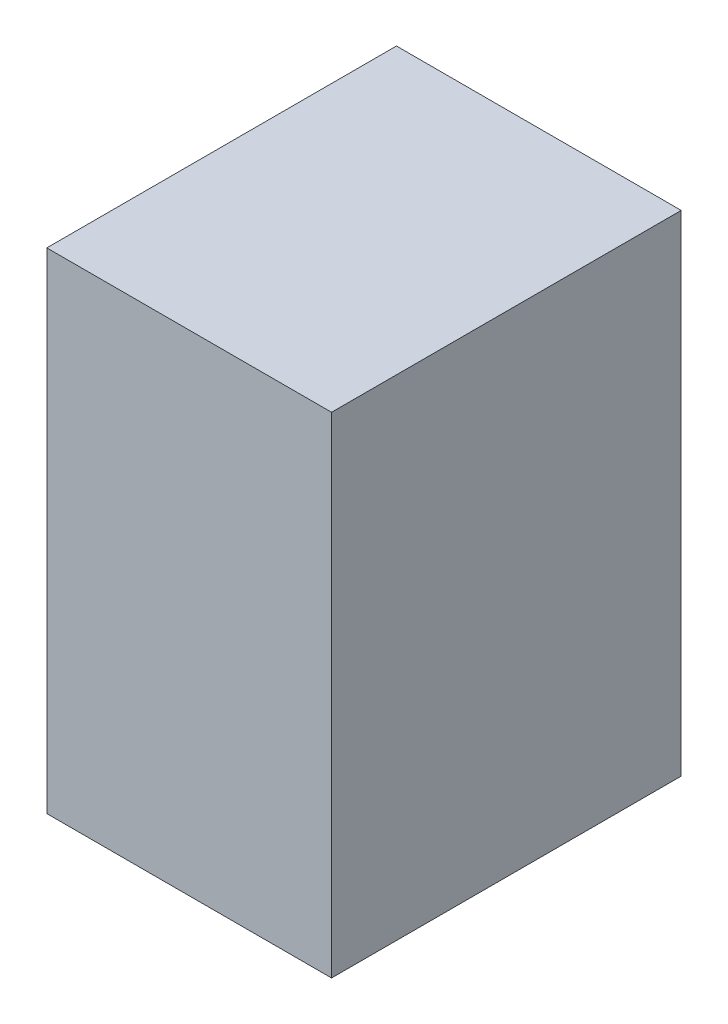
ISO-10303-21;
HEADER;
FILE_DESCRIPTION(('STEP AP214'),'2;1');
FILE_NAME('part.step','',(''),(''),'','','');
FILE_SCHEMA(('AUTOMOTIVE_DESIGN { 1 0 10303 214 1 1 1 1 }'));
ENDSEC;
DATA;
#1=APPLICATION_CONTEXT('core data for automotive mechanical design processes');
#2=APPLICATION_PROTOCOL_DEFINITION('international standard','automotive_design',2000,#1);
#3=PRODUCT_CONTEXT('',#1,'mechanical');
#4=PRODUCT('Part','Part','',(#3));
#5=PRODUCT_RELATED_PRODUCT_CATEGORY('part','',(#4));
#6=PRODUCT_DEFINITION_FORMATION('','',#4);
#7=PRODUCT_DEFINITION_CONTEXT('part definition',#1,'design');
#8=PRODUCT_DEFINITION('design','',#6,#7);
#9=PRODUCT_DEFINITION_SHAPE('','',#8);
#10=(LENGTH_UNIT() NAMED_UNIT(*) SI_UNIT(.MILLI.,.METRE.));
#11=(NAMED_UNIT(*) PLANE_ANGLE_UNIT() SI_UNIT($,.RADIAN.));
#12=(NAMED_UNIT(*) SI_UNIT($,.STERADIAN.) SOLID_ANGLE_UNIT());
#13=UNCERTAINTY_MEASURE_WITH_UNIT(LENGTH_MEASURE(1.E-05),#10,'distance_accuracy_value','');
#14=(GEOMETRIC_REPRESENTATION_CONTEXT(3) GLOBAL_UNCERTAINTY_ASSIGNED_CONTEXT((#13)) GLOBAL_UNIT_ASSIGNED_CONTEXT((#10,
#11,#12)) REPRESENTATION_CONTEXT('',''));
#15=CARTESIAN_POINT('',(0.,0.,0.));
#16=DIRECTION('',(0.,0.,1.));
#17=DIRECTION('',(1.,0.,0.));
#18=AXIS2_PLACEMENT_3D('',#15,#16,#17);
#19=CARTESIAN_POINT('',(-54.8083507387441,117.,-43.6863867275161));
#20=DIRECTION('',(1.,0.,0.));
#21=DIRECTION('',(0.,0.,-1.));
#22=AXIS2_PLACEMENT_3D('',#19,#20,#21);
#23=PLANE('',#22);
#24=DIRECTION('',(0.,0.,1.));
#25=VECTOR('',#24,1.);
#26=CARTESIAN_POINT('',(-54.8083507387441,0.,-43.6863867275161));
#27=LINE('',#26,#25);
#28=CARTESIAN_POINT('',(-54.8083507387441,0.,-43.6863867275161));
#29=VERTEX_POINT('',#28);
#30=CARTESIAN_POINT('',(-54.8083507387441,0.,39.8136132724839));
#31=VERTEX_POINT('',#30);
#32=EDGE_CURVE('E94',#29,#31,#27,.T.);
#33=ORIENTED_EDGE('',*,*,#32,.T.);
#34=DIRECTION('',(0.,-1.,0.));
#35=VECTOR('',#34,1.);
#36=CARTESIAN_POINT('',(-54.8083507387441,117.,39.8136132724839));
#37=LINE('',#36,#35);
#38=CARTESIAN_POINT('',(-54.8083507387441,117.,39.8136132724839));
#39=VERTEX_POINT('',#38);
#40=EDGE_CURVE('E11',#39,#31,#37,.T.);
#41=ORIENTED_EDGE('',*,*,#40,.F.);
#42=DIRECTION('',(0.,0.,1.));
#43=VECTOR('',#42,1.);
#44=CARTESIAN_POINT('',(-54.8083507387441,117.,-43.6863867275161));
#45=LINE('',#44,#43);
#46=CARTESIAN_POINT('',(-54.8083507387441,117.,-43.6863867275161));
#47=VERTEX_POINT('',#46);
#48=EDGE_CURVE('E82',#47,#39,#45,.T.);
#49=ORIENTED_EDGE('',*,*,#48,.F.);
#50=DIRECTION('',(0.,-1.,0.));
#51=VECTOR('',#50,1.);
#52=CARTESIAN_POINT('',(-54.8083507387441,117.,-43.6863867275161));
#53=LINE('',#52,#51);
#54=EDGE_CURVE('E90',#47,#29,#53,.T.);
#55=ORIENTED_EDGE('',*,*,#54,.T.);
#56=EDGE_LOOP('',(#33,#41,#49,#55));
#57=FACE_BOUND('',#56,.T.);
#58=ADVANCED_FACE('F31',(#57),#23,.F.);
#59=CARTESIAN_POINT('',(-54.8083507387441,117.,39.8136132724839));
#60=DIRECTION('',(0.,0.,-1.));
#61=DIRECTION('',(-1.,0.,0.));
#62=AXIS2_PLACEMENT_3D('',#59,#60,#61);
#63=PLANE('',#62);
#64=DIRECTION('',(1.,0.,0.));
#65=VECTOR('',#64,1.);
#66=CARTESIAN_POINT('',(-54.8083507387441,0.,39.8136132724839));
#67=LINE('',#66,#65);
#68=CARTESIAN_POINT('',(13.191649261256,0.,39.8136132724839));
#69=VERTEX_POINT('',#68);
#70=EDGE_CURVE('E86',#31,#69,#67,.T.);
#71=ORIENTED_EDGE('',*,*,#70,.T.);
#72=DIRECTION('',(0.,-1.,0.));
#73=VECTOR('',#72,1.);
#74=CARTESIAN_POINT('',(13.191649261256,117.,39.8136132724839));
#75=LINE('',#74,#73);
#76=CARTESIAN_POINT('',(13.191649261256,117.,39.8136132724839));
#77=VERTEX_POINT('',#76);
#78=EDGE_CURVE('E39',#77,#69,#75,.T.);
#79=ORIENTED_EDGE('',*,*,#78,.F.);
#80=DIRECTION('',(1.,0.,0.));
#81=VECTOR('',#80,1.);
#82=CARTESIAN_POINT('',(-54.8083507387441,117.,39.8136132724839));
#83=LINE('',#82,#81);
#84=EDGE_CURVE('E77',#39,#77,#83,.T.);
#85=ORIENTED_EDGE('',*,*,#84,.F.);
#86=ORIENTED_EDGE('',*,*,#40,.T.);
#87=EDGE_LOOP('',(#71,#79,#85,#86));
#88=FACE_BOUND('',#87,.T.);
#89=ADVANCED_FACE('F85',(#88),#63,.F.);
#90=CARTESIAN_POINT('',(13.1916492612559,117.,-43.6863867275161));
#91=DIRECTION('',(-1.,0.,0.));
#92=DIRECTION('',(0.,0.,1.));
#93=AXIS2_PLACEMENT_3D('',#90,#91,#92);
#94=PLANE('',#93);
#95=DIRECTION('',(0.,0.,-1.));
#96=VECTOR('',#95,1.);
#97=CARTESIAN_POINT('',(13.1916492612559,0.,-43.6863867275161));
#98=LINE('',#97,#96);
#99=CARTESIAN_POINT('',(13.1916492612559,0.,-43.6863867275161));
#100=VERTEX_POINT('',#99);
#101=EDGE_CURVE('E64',#69,#100,#98,.T.);
#102=ORIENTED_EDGE('',*,*,#101,.T.);
#103=DIRECTION('',(0.,-1.,0.));
#104=VECTOR('',#103,1.);
#105=CARTESIAN_POINT('',(13.1916492612559,117.,-43.6863867275161));
#106=LINE('',#105,#104);
#107=CARTESIAN_POINT('',(13.1916492612559,117.,-43.6863867275161));
#108=VERTEX_POINT('',#107);
#109=EDGE_CURVE('E87',#108,#100,#106,.T.);
#110=ORIENTED_EDGE('',*,*,#109,.F.);
#111=DIRECTION('',(0.,0.,-1.));
#112=VECTOR('',#111,1.);
#113=CARTESIAN_POINT('',(13.1916492612559,117.,-43.6863867275161));
#114=LINE('',#113,#112);
#115=EDGE_CURVE('E80',#77,#108,#114,.T.);
#116=ORIENTED_EDGE('',*,*,#115,.F.);
#117=ORIENTED_EDGE('',*,*,#78,.T.);
#118=EDGE_LOOP('',(#102,#110,#116,#117));
#119=FACE_BOUND('',#118,.T.);
#120=ADVANCED_FACE('F88',(#119),#94,.F.);
#121=CARTESIAN_POINT('',(-54.8083507387441,117.,-43.6863867275161));
#122=DIRECTION('',(0.,0.,1.));
#123=DIRECTION('',(1.,0.,0.));
#124=AXIS2_PLACEMENT_3D('',#121,#122,#123);
#125=PLANE('',#124);
#126=DIRECTION('',(-1.,0.,0.));
#127=VECTOR('',#126,1.);
#128=CARTESIAN_POINT('',(-54.8083507387441,0.,-43.6863867275161));
#129=LINE('',#128,#127);
#130=EDGE_CURVE('E70',#100,#29,#129,.T.);
#131=ORIENTED_EDGE('',*,*,#130,.T.);
#132=ORIENTED_EDGE('',*,*,#54,.F.);
#133=DIRECTION('',(-1.,0.,0.));
#134=VECTOR('',#133,1.);
#135=CARTESIAN_POINT('',(-54.8083507387441,117.,-43.6863867275161));
#136=LINE('',#135,#134);
#137=EDGE_CURVE('E47',#108,#47,#136,.T.);
#138=ORIENTED_EDGE('',*,*,#137,.F.);
#139=ORIENTED_EDGE('',*,*,#109,.T.);
#140=EDGE_LOOP('',(#131,#132,#138,#139));
#141=FACE_BOUND('',#140,.T.);
#142=ADVANCED_FACE('F101',(#141),#125,.F.);
#143=CARTESIAN_POINT('',(-54.8083507387441,117.,39.8136132724839));
#144=DIRECTION('',(0.,1.,0.));
#145=DIRECTION('',(0.,0.,1.));
#146=AXIS2_PLACEMENT_3D('',#143,#144,#145);
#147=PLANE('',#146);
#148=ORIENTED_EDGE('',*,*,#48,.T.);
#149=ORIENTED_EDGE('',*,*,#84,.T.);
#150=ORIENTED_EDGE('',*,*,#115,.T.);
#151=ORIENTED_EDGE('',*,*,#137,.T.);
#152=EDGE_LOOP('',(#148,#149,#150,#151));
#153=FACE_BOUND('',#152,.T.);
#154=ADVANCED_FACE('F78',(#153),#147,.T.);
#155=CARTESIAN_POINT('',(-54.8083507387441,0.,39.8136132724839));
#156=DIRECTION('',(0.,1.,0.));
#157=DIRECTION('',(0.,0.,1.));
#158=AXIS2_PLACEMENT_3D('',#155,#156,#157);
#159=PLANE('',#158);
#160=ORIENTED_EDGE('',*,*,#32,.F.);
#161=ORIENTED_EDGE('',*,*,#130,.F.);
#162=ORIENTED_EDGE('',*,*,#101,.F.);
#163=ORIENTED_EDGE('',*,*,#70,.F.);
#164=EDGE_LOOP('',(#160,#161,#162,#163));
#165=FACE_BOUND('',#164,.T.);
#166=ADVANCED_FACE('F104',(#165),#159,.F.);
#167=CLOSED_SHELL('',(#58,#89,#120,#142,#154,#166));
#168=MANIFOLD_SOLID_BREP('B2',#167);
#169=ADVANCED_BREP_SHAPE_REPRESENTATION('',(#18,#168),#14);
#170=SHAPE_DEFINITION_REPRESENTATION(#9,#169);
ENDSEC;
END-ISO-10303-21;
